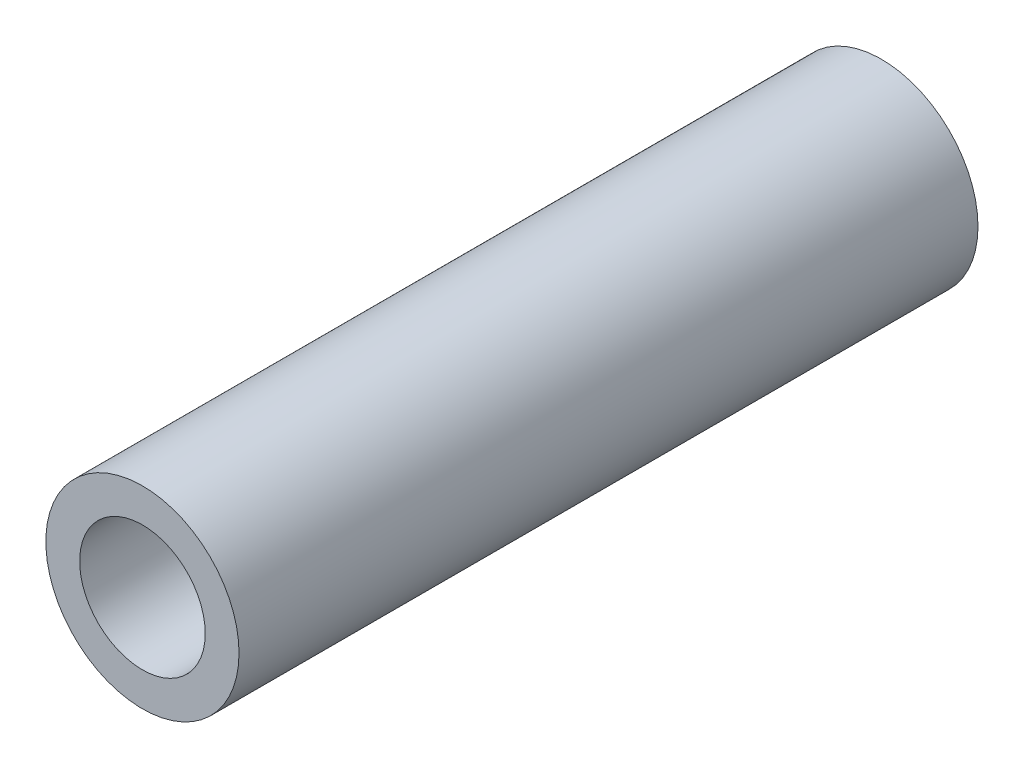
ISO-10303-21;
HEADER;
FILE_DESCRIPTION(('STEP AP214'),'2;1');
FILE_NAME('part.step','',(''),(''),'','','');
FILE_SCHEMA(('AUTOMOTIVE_DESIGN { 1 0 10303 214 1 1 1 1 }'));
ENDSEC;
DATA;
#1=APPLICATION_CONTEXT('core data for automotive mechanical design processes');
#2=APPLICATION_PROTOCOL_DEFINITION('international standard','automotive_design',2000,#1);
#3=PRODUCT_CONTEXT('',#1,'mechanical');
#4=PRODUCT('Part','Part','',(#3));
#5=PRODUCT_RELATED_PRODUCT_CATEGORY('part','',(#4));
#6=PRODUCT_DEFINITION_FORMATION('','',#4);
#7=PRODUCT_DEFINITION_CONTEXT('part definition',#1,'design');
#8=PRODUCT_DEFINITION('design','',#6,#7);
#9=PRODUCT_DEFINITION_SHAPE('','',#8);
#10=(LENGTH_UNIT() NAMED_UNIT(*) SI_UNIT(.MILLI.,.METRE.));
#11=(NAMED_UNIT(*) PLANE_ANGLE_UNIT() SI_UNIT($,.RADIAN.));
#12=(NAMED_UNIT(*) SI_UNIT($,.STERADIAN.) SOLID_ANGLE_UNIT());
#13=UNCERTAINTY_MEASURE_WITH_UNIT(LENGTH_MEASURE(1.E-05),#10,'distance_accuracy_value','');
#14=(GEOMETRIC_REPRESENTATION_CONTEXT(3) GLOBAL_UNCERTAINTY_ASSIGNED_CONTEXT((#13)) GLOBAL_UNIT_ASSIGNED_CONTEXT((#10,
#11,#12)) REPRESENTATION_CONTEXT('',''));
#15=CARTESIAN_POINT('',(0.,0.,0.));
#16=DIRECTION('',(0.,0.,1.));
#17=DIRECTION('',(1.,0.,0.));
#18=AXIS2_PLACEMENT_3D('',#15,#16,#17);
#19=CARTESIAN_POINT('',(0.,0.,-15.3));
#20=DIRECTION('',(0.,0.,1.));
#21=DIRECTION('',(1.,0.,0.));
#22=AXIS2_PLACEMENT_3D('',#19,#20,#21);
#23=CYLINDRICAL_SURFACE('',#22,2.);
#24=CARTESIAN_POINT('',(0.,0.,-15.3));
#25=DIRECTION('',(0.,0.,1.));
#26=DIRECTION('',(1.,0.,0.));
#27=AXIS2_PLACEMENT_3D('',#24,#25,#26);
#28=CIRCLE('',#27,2.);
#29=CARTESIAN_POINT('',(2.,0.,-15.3));
#30=VERTEX_POINT('',#29);
#31=EDGE_CURVE('E10',#30,#30,#28,.T.);
#32=ORIENTED_EDGE('',*,*,#31,.T.);
#33=EDGE_LOOP('',(#32));
#34=FACE_BOUND('',#33,.T.);
#35=CARTESIAN_POINT('',(0.,0.,0.));
#36=DIRECTION('',(0.,0.,1.));
#37=DIRECTION('',(1.,0.,0.));
#38=AXIS2_PLACEMENT_3D('',#35,#36,#37);
#39=CIRCLE('',#38,2.);
#40=CARTESIAN_POINT('',(2.,0.,0.));
#41=VERTEX_POINT('',#40);
#42=EDGE_CURVE('E35',#41,#41,#39,.T.);
#43=ORIENTED_EDGE('',*,*,#42,.F.);
#44=EDGE_LOOP('',(#43));
#45=FACE_BOUND('',#44,.T.);
#46=ADVANCED_FACE('F32',(#34,#45),#23,.T.);
#47=CARTESIAN_POINT('',(0.,0.,-15.3));
#48=DIRECTION('',(0.,0.,1.));
#49=DIRECTION('',(1.,0.,0.));
#50=AXIS2_PLACEMENT_3D('',#47,#48,#49);
#51=PLANE('',#50);
#52=CARTESIAN_POINT('',(0.,0.,-15.3));
#53=DIRECTION('',(0.,0.,1.));
#54=DIRECTION('',(1.,0.,0.));
#55=AXIS2_PLACEMENT_3D('',#52,#53,#54);
#56=CIRCLE('',#55,1.3);
#57=CARTESIAN_POINT('',(1.3,0.,-15.3));
#58=VERTEX_POINT('',#57);
#59=EDGE_CURVE('E42',#58,#58,#56,.T.);
#60=ORIENTED_EDGE('',*,*,#59,.T.);
#61=EDGE_LOOP('',(#60));
#62=FACE_BOUND('',#61,.T.);
#63=ORIENTED_EDGE('',*,*,#31,.F.);
#64=EDGE_LOOP('',(#63));
#65=FACE_BOUND('',#64,.T.);
#66=ADVANCED_FACE('F50',(#62,#65),#51,.F.);
#67=CARTESIAN_POINT('',(0.,0.,0.));
#68=DIRECTION('',(0.,0.,1.));
#69=DIRECTION('',(1.,0.,0.));
#70=AXIS2_PLACEMENT_3D('',#67,#68,#69);
#71=PLANE('',#70);
#72=CARTESIAN_POINT('',(0.,0.,0.));
#73=DIRECTION('',(0.,0.,1.));
#74=DIRECTION('',(1.,0.,0.));
#75=AXIS2_PLACEMENT_3D('',#72,#73,#74);
#76=CIRCLE('',#75,1.3);
#77=CARTESIAN_POINT('',(1.3,0.,0.));
#78=VERTEX_POINT('',#77);
#79=EDGE_CURVE('E44',#78,#78,#76,.T.);
#80=ORIENTED_EDGE('',*,*,#79,.F.);
#81=EDGE_LOOP('',(#80));
#82=FACE_BOUND('',#81,.T.);
#83=ORIENTED_EDGE('',*,*,#42,.T.);
#84=EDGE_LOOP('',(#83));
#85=FACE_BOUND('',#84,.T.);
#86=ADVANCED_FACE('F56',(#82,#85),#71,.T.);
#87=CARTESIAN_POINT('',(0.,0.,-15.3));
#88=DIRECTION('',(0.,0.,1.));
#89=DIRECTION('',(1.,0.,0.));
#90=AXIS2_PLACEMENT_3D('',#87,#88,#89);
#91=CYLINDRICAL_SURFACE('',#90,1.3);
#92=ORIENTED_EDGE('',*,*,#59,.F.);
#93=EDGE_LOOP('',(#92));
#94=FACE_BOUND('',#93,.T.);
#95=ORIENTED_EDGE('',*,*,#79,.T.);
#96=EDGE_LOOP('',(#95));
#97=FACE_BOUND('',#96,.T.);
#98=ADVANCED_FACE('F53',(#94,#97),#91,.F.);
#99=CLOSED_SHELL('',(#46,#66,#86,#98));
#100=MANIFOLD_SOLID_BREP('B2',#99);
#101=ADVANCED_BREP_SHAPE_REPRESENTATION('',(#18,#100),#14);
#102=SHAPE_DEFINITION_REPRESENTATION(#9,#101);
ENDSEC;
END-ISO-10303-21;
